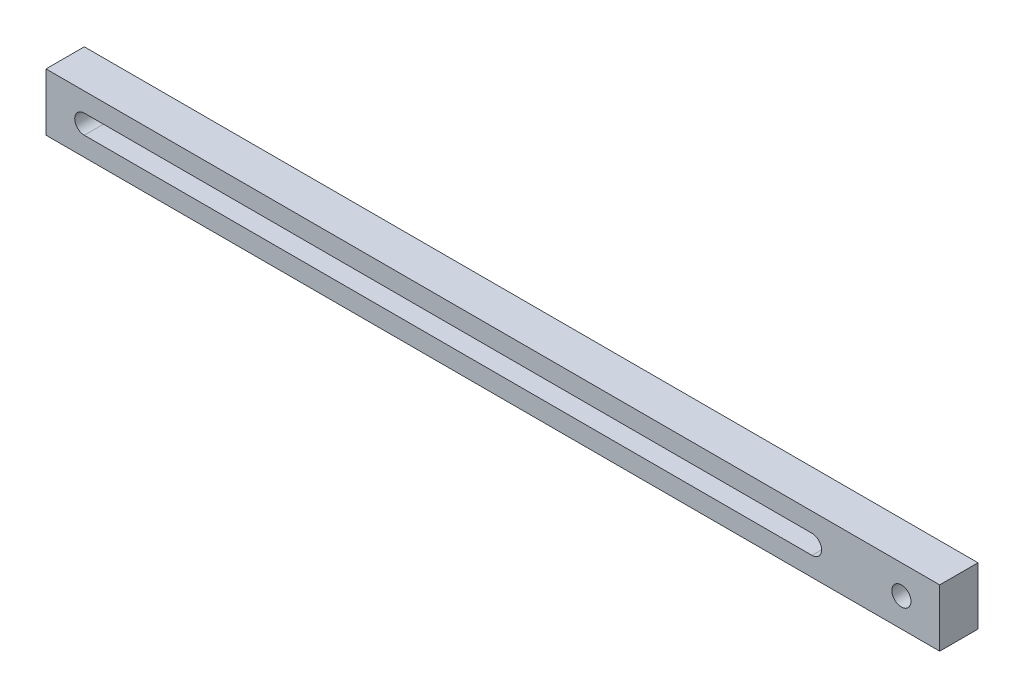
ISO-10303-21;
HEADER;
FILE_DESCRIPTION(('STEP AP214'),'2;1');
FILE_NAME('part.step','',(''),(''),'','','');
FILE_SCHEMA(('AUTOMOTIVE_DESIGN { 1 0 10303 214 1 1 1 1 }'));
ENDSEC;
DATA;
#1=APPLICATION_CONTEXT('core data for automotive mechanical design processes');
#2=APPLICATION_PROTOCOL_DEFINITION('international standard','automotive_design',2000,#1);
#3=PRODUCT_CONTEXT('',#1,'mechanical');
#4=PRODUCT('Part','Part','',(#3));
#5=PRODUCT_RELATED_PRODUCT_CATEGORY('part','',(#4));
#6=PRODUCT_DEFINITION_FORMATION('','',#4);
#7=PRODUCT_DEFINITION_CONTEXT('part definition',#1,'design');
#8=PRODUCT_DEFINITION('design','',#6,#7);
#9=PRODUCT_DEFINITION_SHAPE('','',#8);
#10=(LENGTH_UNIT() NAMED_UNIT(*) SI_UNIT(.MILLI.,.METRE.));
#11=(NAMED_UNIT(*) PLANE_ANGLE_UNIT() SI_UNIT($,.RADIAN.));
#12=(NAMED_UNIT(*) SI_UNIT($,.STERADIAN.) SOLID_ANGLE_UNIT());
#13=UNCERTAINTY_MEASURE_WITH_UNIT(LENGTH_MEASURE(1.E-05),#10,'distance_accuracy_value','');
#14=(GEOMETRIC_REPRESENTATION_CONTEXT(3) GLOBAL_UNCERTAINTY_ASSIGNED_CONTEXT((#13)) GLOBAL_UNIT_ASSIGNED_CONTEXT((#10,
#11,#12)) REPRESENTATION_CONTEXT('',''));
#15=CARTESIAN_POINT('',(0.,0.,0.));
#16=DIRECTION('',(0.,0.,1.));
#17=DIRECTION('',(1.,0.,0.));
#18=AXIS2_PLACEMENT_3D('',#15,#16,#17);
#19=CARTESIAN_POINT('',(0.,0.,-30.));
#20=DIRECTION('',(-1.,0.,0.));
#21=DIRECTION('',(0.,0.,1.));
#22=AXIS2_PLACEMENT_3D('',#19,#20,#21);
#23=PLANE('',#22);
#24=DIRECTION('',(0.,-1.,0.));
#25=VECTOR('',#24,1.);
#26=CARTESIAN_POINT('',(0.,0.,0.));
#27=LINE('',#26,#25);
#28=CARTESIAN_POINT('',(0.,45.,0.));
#29=VERTEX_POINT('',#28);
#30=CARTESIAN_POINT('',(0.,0.,0.));
#31=VERTEX_POINT('',#30);
#32=EDGE_CURVE('E118',#29,#31,#27,.T.);
#33=ORIENTED_EDGE('',*,*,#32,.F.);
#34=DIRECTION('',(0.,0.,1.));
#35=VECTOR('',#34,1.);
#36=CARTESIAN_POINT('',(0.,45.,-30.));
#37=LINE('',#36,#35);
#38=CARTESIAN_POINT('',(0.,45.,-30.));
#39=VERTEX_POINT('',#38);
#40=EDGE_CURVE('E10',#39,#29,#37,.T.);
#41=ORIENTED_EDGE('',*,*,#40,.F.);
#42=DIRECTION('',(0.,-1.,0.));
#43=VECTOR('',#42,1.);
#44=CARTESIAN_POINT('',(0.,0.,-30.));
#45=LINE('',#44,#43);
#46=CARTESIAN_POINT('',(0.,0.,-30.));
#47=VERTEX_POINT('',#46);
#48=EDGE_CURVE('E122',#39,#47,#45,.T.);
#49=ORIENTED_EDGE('',*,*,#48,.T.);
#50=DIRECTION('',(0.,0.,1.));
#51=VECTOR('',#50,1.);
#52=CARTESIAN_POINT('',(0.,0.,-30.));
#53=LINE('',#52,#51);
#54=EDGE_CURVE('E19',#47,#31,#53,.T.);
#55=ORIENTED_EDGE('',*,*,#54,.T.);
#56=EDGE_LOOP('',(#33,#41,#49,#55));
#57=FACE_BOUND('',#56,.T.);
#58=ADVANCED_FACE('F16',(#57),#23,.T.);
#59=CARTESIAN_POINT('',(0.,45.,-30.));
#60=DIRECTION('',(0.,1.,0.));
#61=DIRECTION('',(0.,0.,1.));
#62=AXIS2_PLACEMENT_3D('',#59,#60,#61);
#63=PLANE('',#62);
#64=DIRECTION('',(-1.,0.,0.));
#65=VECTOR('',#64,1.);
#66=CARTESIAN_POINT('',(0.,45.,0.));
#67=LINE('',#66,#65);
#68=CARTESIAN_POINT('',(700.,45.,0.));
#69=VERTEX_POINT('',#68);
#70=EDGE_CURVE('E126',#69,#29,#67,.T.);
#71=ORIENTED_EDGE('',*,*,#70,.F.);
#72=DIRECTION('',(0.,0.,1.));
#73=VECTOR('',#72,1.);
#74=CARTESIAN_POINT('',(700.,45.,-30.));
#75=LINE('',#74,#73);
#76=CARTESIAN_POINT('',(700.,45.,-30.));
#77=VERTEX_POINT('',#76);
#78=EDGE_CURVE('E24',#77,#69,#75,.T.);
#79=ORIENTED_EDGE('',*,*,#78,.F.);
#80=DIRECTION('',(-1.,0.,0.));
#81=VECTOR('',#80,1.);
#82=CARTESIAN_POINT('',(0.,45.,-30.));
#83=LINE('',#82,#81);
#84=EDGE_CURVE('E132',#77,#39,#83,.T.);
#85=ORIENTED_EDGE('',*,*,#84,.T.);
#86=ORIENTED_EDGE('',*,*,#40,.T.);
#87=EDGE_LOOP('',(#71,#79,#85,#86));
#88=FACE_BOUND('',#87,.T.);
#89=ADVANCED_FACE('F158',(#88),#63,.T.);
#90=CARTESIAN_POINT('',(700.,0.,-30.));
#91=DIRECTION('',(1.,0.,0.));
#92=DIRECTION('',(0.,0.,-1.));
#93=AXIS2_PLACEMENT_3D('',#90,#91,#92);
#94=PLANE('',#93);
#95=DIRECTION('',(0.,1.,0.));
#96=VECTOR('',#95,1.);
#97=CARTESIAN_POINT('',(700.,0.,0.));
#98=LINE('',#97,#96);
#99=CARTESIAN_POINT('',(700.,0.,0.));
#100=VERTEX_POINT('',#99);
#101=EDGE_CURVE('E140',#100,#69,#98,.T.);
#102=ORIENTED_EDGE('',*,*,#101,.F.);
#103=DIRECTION('',(0.,0.,1.));
#104=VECTOR('',#103,1.);
#105=CARTESIAN_POINT('',(700.,0.,-30.));
#106=LINE('',#105,#104);
#107=CARTESIAN_POINT('',(700.,0.,-30.));
#108=VERTEX_POINT('',#107);
#109=EDGE_CURVE('E145',#108,#100,#106,.T.);
#110=ORIENTED_EDGE('',*,*,#109,.F.);
#111=DIRECTION('',(0.,1.,0.));
#112=VECTOR('',#111,1.);
#113=CARTESIAN_POINT('',(700.,0.,-30.));
#114=LINE('',#113,#112);
#115=EDGE_CURVE('E129',#108,#77,#114,.T.);
#116=ORIENTED_EDGE('',*,*,#115,.T.);
#117=ORIENTED_EDGE('',*,*,#78,.T.);
#118=EDGE_LOOP('',(#102,#110,#116,#117));
#119=FACE_BOUND('',#118,.T.);
#120=ADVANCED_FACE('F162',(#119),#94,.T.);
#121=CARTESIAN_POINT('',(0.,0.,-30.));
#122=DIRECTION('',(0.,-1.,0.));
#123=DIRECTION('',(0.,0.,-1.));
#124=AXIS2_PLACEMENT_3D('',#121,#122,#123);
#125=PLANE('',#124);
#126=DIRECTION('',(1.,0.,0.));
#127=VECTOR('',#126,1.);
#128=CARTESIAN_POINT('',(0.,0.,0.));
#129=LINE('',#128,#127);
#130=EDGE_CURVE('E137',#31,#100,#129,.T.);
#131=ORIENTED_EDGE('',*,*,#130,.F.);
#132=ORIENTED_EDGE('',*,*,#54,.F.);
#133=DIRECTION('',(1.,0.,0.));
#134=VECTOR('',#133,1.);
#135=CARTESIAN_POINT('',(0.,0.,-30.));
#136=LINE('',#135,#134);
#137=EDGE_CURVE('E125',#47,#108,#136,.T.);
#138=ORIENTED_EDGE('',*,*,#137,.T.);
#139=ORIENTED_EDGE('',*,*,#109,.T.);
#140=EDGE_LOOP('',(#131,#132,#138,#139));
#141=FACE_BOUND('',#140,.T.);
#142=ADVANCED_FACE('F153',(#141),#125,.T.);
#143=CARTESIAN_POINT('',(0.,45.,-30.));
#144=DIRECTION('',(0.,0.,-1.));
#145=DIRECTION('',(-1.,0.,0.));
#146=AXIS2_PLACEMENT_3D('',#143,#144,#145);
#147=PLANE('',#146);
#148=CARTESIAN_POINT('',(670.,22.5,-30.));
#149=DIRECTION('',(0.,0.,1.));
#150=DIRECTION('',(1.,0.,0.));
#151=AXIS2_PLACEMENT_3D('',#148,#149,#150);
#152=CIRCLE('',#151,7.5);
#153=CARTESIAN_POINT('',(677.5,22.5,-30.));
#154=VERTEX_POINT('',#153);
#155=EDGE_CURVE('E112',#154,#154,#152,.T.);
#156=ORIENTED_EDGE('',*,*,#155,.T.);
#157=EDGE_LOOP('',(#156));
#158=FACE_BOUND('',#157,.T.);
#159=CARTESIAN_POINT('',(30.,22.5,-30.));
#160=DIRECTION('',(0.,0.,1.));
#161=DIRECTION('',(1.,0.,0.));
#162=AXIS2_PLACEMENT_3D('',#159,#160,#161);
#163=CIRCLE('',#162,7.5);
#164=CARTESIAN_POINT('',(30.,30.,-30.));
#165=VERTEX_POINT('',#164);
#166=CARTESIAN_POINT('',(30.,15.,-30.));
#167=VERTEX_POINT('',#166);
#168=EDGE_CURVE('E83',#165,#167,#163,.T.);
#169=ORIENTED_EDGE('',*,*,#168,.T.);
#170=DIRECTION('',(1.,0.,0.));
#171=VECTOR('',#170,1.);
#172=CARTESIAN_POINT('',(30.,15.,-30.));
#173=LINE('',#172,#171);
#174=CARTESIAN_POINT('',(600.,15.,-30.));
#175=VERTEX_POINT('',#174);
#176=EDGE_CURVE('E92',#167,#175,#173,.T.);
#177=ORIENTED_EDGE('',*,*,#176,.T.);
#178=CARTESIAN_POINT('',(600.,22.5,-30.));
#179=DIRECTION('',(0.,0.,1.));
#180=DIRECTION('',(1.,0.,0.));
#181=AXIS2_PLACEMENT_3D('',#178,#179,#180);
#182=CIRCLE('',#181,7.5);
#183=CARTESIAN_POINT('',(600.,30.,-30.));
#184=VERTEX_POINT('',#183);
#185=EDGE_CURVE('E32',#175,#184,#182,.T.);
#186=ORIENTED_EDGE('',*,*,#185,.T.);
#187=DIRECTION('',(-1.,0.,0.));
#188=VECTOR('',#187,1.);
#189=CARTESIAN_POINT('',(30.,30.,-30.));
#190=LINE('',#189,#188);
#191=EDGE_CURVE('E89',#184,#165,#190,.T.);
#192=ORIENTED_EDGE('',*,*,#191,.T.);
#193=EDGE_LOOP('',(#169,#177,#186,#192));
#194=FACE_BOUND('',#193,.T.);
#195=ORIENTED_EDGE('',*,*,#48,.F.);
#196=ORIENTED_EDGE('',*,*,#84,.F.);
#197=ORIENTED_EDGE('',*,*,#115,.F.);
#198=ORIENTED_EDGE('',*,*,#137,.F.);
#199=EDGE_LOOP('',(#195,#196,#197,#198));
#200=FACE_BOUND('',#199,.T.);
#201=ADVANCED_FACE('F96',(#158,#194,#200),#147,.T.);
#202=CARTESIAN_POINT('',(0.,45.,0.));
#203=DIRECTION('',(0.,0.,-1.));
#204=DIRECTION('',(-1.,0.,0.));
#205=AXIS2_PLACEMENT_3D('',#202,#203,#204);
#206=PLANE('',#205);
#207=CARTESIAN_POINT('',(670.,22.5,0.));
#208=DIRECTION('',(0.,0.,1.));
#209=DIRECTION('',(1.,0.,0.));
#210=AXIS2_PLACEMENT_3D('',#207,#208,#209);
#211=CIRCLE('',#210,7.5);
#212=CARTESIAN_POINT('',(677.5,22.5,0.));
#213=VERTEX_POINT('',#212);
#214=EDGE_CURVE('E105',#213,#213,#211,.T.);
#215=ORIENTED_EDGE('',*,*,#214,.F.);
#216=EDGE_LOOP('',(#215));
#217=FACE_BOUND('',#216,.T.);
#218=DIRECTION('',(1.,0.,0.));
#219=VECTOR('',#218,1.);
#220=CARTESIAN_POINT('',(30.,15.,0.));
#221=LINE('',#220,#219);
#222=CARTESIAN_POINT('',(30.,15.,0.));
#223=VERTEX_POINT('',#222);
#224=CARTESIAN_POINT('',(600.,15.,0.));
#225=VERTEX_POINT('',#224);
#226=EDGE_CURVE('E111',#223,#225,#221,.T.);
#227=ORIENTED_EDGE('',*,*,#226,.F.);
#228=CARTESIAN_POINT('',(30.,22.5,0.));
#229=DIRECTION('',(0.,0.,1.));
#230=DIRECTION('',(1.,0.,0.));
#231=AXIS2_PLACEMENT_3D('',#228,#229,#230);
#232=CIRCLE('',#231,7.5);
#233=CARTESIAN_POINT('',(30.,30.,0.));
#234=VERTEX_POINT('',#233);
#235=EDGE_CURVE('E40',#234,#223,#232,.T.);
#236=ORIENTED_EDGE('',*,*,#235,.F.);
#237=DIRECTION('',(-1.,0.,0.));
#238=VECTOR('',#237,1.);
#239=CARTESIAN_POINT('',(30.,30.,0.));
#240=LINE('',#239,#238);
#241=CARTESIAN_POINT('',(600.,30.,0.));
#242=VERTEX_POINT('',#241);
#243=EDGE_CURVE('E99',#242,#234,#240,.T.);
#244=ORIENTED_EDGE('',*,*,#243,.F.);
#245=CARTESIAN_POINT('',(600.,22.5,0.));
#246=DIRECTION('',(0.,0.,1.));
#247=DIRECTION('',(1.,0.,0.));
#248=AXIS2_PLACEMENT_3D('',#245,#246,#247);
#249=CIRCLE('',#248,7.5);
#250=EDGE_CURVE('E102',#225,#242,#249,.T.);
#251=ORIENTED_EDGE('',*,*,#250,.F.);
#252=EDGE_LOOP('',(#227,#236,#244,#251));
#253=FACE_BOUND('',#252,.T.);
#254=ORIENTED_EDGE('',*,*,#32,.T.);
#255=ORIENTED_EDGE('',*,*,#130,.T.);
#256=ORIENTED_EDGE('',*,*,#101,.T.);
#257=ORIENTED_EDGE('',*,*,#70,.T.);
#258=EDGE_LOOP('',(#254,#255,#256,#257));
#259=FACE_BOUND('',#258,.T.);
#260=ADVANCED_FACE('F155',(#217,#253,#259),#206,.F.);
#261=CARTESIAN_POINT('',(30.,22.5,-30.));
#262=DIRECTION('',(0.,0.,1.));
#263=DIRECTION('',(1.,0.,0.));
#264=AXIS2_PLACEMENT_3D('',#261,#262,#263);
#265=CYLINDRICAL_SURFACE('',#264,7.5);
#266=ORIENTED_EDGE('',*,*,#235,.T.);
#267=DIRECTION('',(0.,0.,1.));
#268=VECTOR('',#267,1.);
#269=CARTESIAN_POINT('',(30.,15.,-30.));
#270=LINE('',#269,#268);
#271=EDGE_CURVE('E79',#167,#223,#270,.T.);
#272=ORIENTED_EDGE('',*,*,#271,.F.);
#273=ORIENTED_EDGE('',*,*,#168,.F.);
#274=DIRECTION('',(0.,0.,1.));
#275=VECTOR('',#274,1.);
#276=CARTESIAN_POINT('',(30.,30.,-30.));
#277=LINE('',#276,#275);
#278=EDGE_CURVE('E116',#165,#234,#277,.T.);
#279=ORIENTED_EDGE('',*,*,#278,.T.);
#280=EDGE_LOOP('',(#266,#272,#273,#279));
#281=FACE_BOUND('',#280,.T.);
#282=ADVANCED_FACE('F81',(#281),#265,.F.);
#283=CARTESIAN_POINT('',(30.,30.,-30.));
#284=DIRECTION('',(0.,1.,0.));
#285=DIRECTION('',(0.,0.,1.));
#286=AXIS2_PLACEMENT_3D('',#283,#284,#285);
#287=PLANE('',#286);
#288=ORIENTED_EDGE('',*,*,#243,.T.);
#289=ORIENTED_EDGE('',*,*,#278,.F.);
#290=ORIENTED_EDGE('',*,*,#191,.F.);
#291=DIRECTION('',(0.,0.,1.));
#292=VECTOR('',#291,1.);
#293=CARTESIAN_POINT('',(600.,30.,-30.));
#294=LINE('',#293,#292);
#295=EDGE_CURVE('E119',#184,#242,#294,.T.);
#296=ORIENTED_EDGE('',*,*,#295,.T.);
#297=EDGE_LOOP('',(#288,#289,#290,#296));
#298=FACE_BOUND('',#297,.T.);
#299=ADVANCED_FACE('F221',(#298),#287,.F.);
#300=CARTESIAN_POINT('',(600.,22.5,-30.));
#301=DIRECTION('',(0.,0.,1.));
#302=DIRECTION('',(1.,0.,0.));
#303=AXIS2_PLACEMENT_3D('',#300,#301,#302);
#304=CYLINDRICAL_SURFACE('',#303,7.5);
#305=ORIENTED_EDGE('',*,*,#250,.T.);
#306=ORIENTED_EDGE('',*,*,#295,.F.);
#307=ORIENTED_EDGE('',*,*,#185,.F.);
#308=DIRECTION('',(0.,0.,1.));
#309=VECTOR('',#308,1.);
#310=CARTESIAN_POINT('',(600.,15.,-30.));
#311=LINE('',#310,#309);
#312=EDGE_CURVE('E88',#175,#225,#311,.T.);
#313=ORIENTED_EDGE('',*,*,#312,.T.);
#314=EDGE_LOOP('',(#305,#306,#307,#313));
#315=FACE_BOUND('',#314,.T.);
#316=ADVANCED_FACE('F229',(#315),#304,.F.);
#317=CARTESIAN_POINT('',(30.,15.,-30.));
#318=DIRECTION('',(0.,-1.,0.));
#319=DIRECTION('',(0.,0.,-1.));
#320=AXIS2_PLACEMENT_3D('',#317,#318,#319);
#321=PLANE('',#320);
#322=ORIENTED_EDGE('',*,*,#226,.T.);
#323=ORIENTED_EDGE('',*,*,#312,.F.);
#324=ORIENTED_EDGE('',*,*,#176,.F.);
#325=ORIENTED_EDGE('',*,*,#271,.T.);
#326=EDGE_LOOP('',(#322,#323,#324,#325));
#327=FACE_BOUND('',#326,.T.);
#328=ADVANCED_FACE('F93',(#327),#321,.F.);
#329=CARTESIAN_POINT('',(670.,22.5,-30.));
#330=DIRECTION('',(0.,0.,1.));
#331=DIRECTION('',(1.,0.,0.));
#332=AXIS2_PLACEMENT_3D('',#329,#330,#331);
#333=CYLINDRICAL_SURFACE('',#332,7.5);
#334=ORIENTED_EDGE('',*,*,#155,.F.);
#335=EDGE_LOOP('',(#334));
#336=FACE_BOUND('',#335,.T.);
#337=ORIENTED_EDGE('',*,*,#214,.T.);
#338=EDGE_LOOP('',(#337));
#339=FACE_BOUND('',#338,.T.);
#340=ADVANCED_FACE('F245',(#336,#339),#333,.F.);
#341=CLOSED_SHELL('',(#58,#89,#120,#142,#201,#260,#282,#299,#316,#328,#340));
#342=MANIFOLD_SOLID_BREP('B1',#341);
#343=ADVANCED_BREP_SHAPE_REPRESENTATION('',(#18,#342),#14);
#344=SHAPE_DEFINITION_REPRESENTATION(#9,#343);
ENDSEC;
END-ISO-10303-21;
